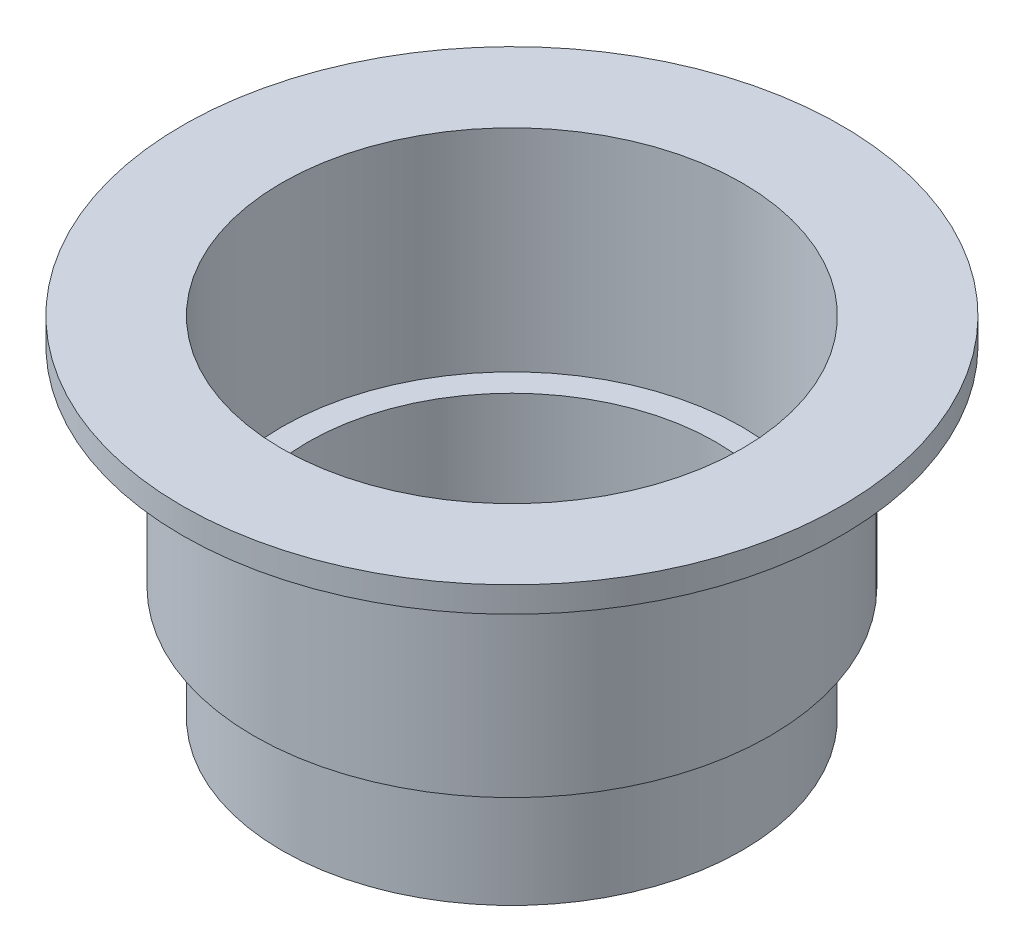
ISO-10303-21;
HEADER;
FILE_DESCRIPTION(('STEP AP214'),'2;1');
FILE_NAME('part.step','',(''),(''),'','','');
FILE_SCHEMA(('AUTOMOTIVE_DESIGN { 1 0 10303 214 1 1 1 1 }'));
ENDSEC;
DATA;
#1=APPLICATION_CONTEXT('core data for automotive mechanical design processes');
#2=APPLICATION_PROTOCOL_DEFINITION('international standard','automotive_design',2000,#1);
#3=PRODUCT_CONTEXT('',#1,'mechanical');
#4=PRODUCT('Part','Part','',(#3));
#5=PRODUCT_RELATED_PRODUCT_CATEGORY('part','',(#4));
#6=PRODUCT_DEFINITION_FORMATION('','',#4);
#7=PRODUCT_DEFINITION_CONTEXT('part definition',#1,'design');
#8=PRODUCT_DEFINITION('design','',#6,#7);
#9=PRODUCT_DEFINITION_SHAPE('','',#8);
#10=(LENGTH_UNIT() NAMED_UNIT(*) SI_UNIT(.MILLI.,.METRE.));
#11=(NAMED_UNIT(*) PLANE_ANGLE_UNIT() SI_UNIT($,.RADIAN.));
#12=(NAMED_UNIT(*) SI_UNIT($,.STERADIAN.) SOLID_ANGLE_UNIT());
#13=UNCERTAINTY_MEASURE_WITH_UNIT(LENGTH_MEASURE(1.E-05),#10,'distance_accuracy_value','');
#14=(GEOMETRIC_REPRESENTATION_CONTEXT(3) GLOBAL_UNCERTAINTY_ASSIGNED_CONTEXT((#13)) GLOBAL_UNIT_ASSIGNED_CONTEXT((#10,
#11,#12)) REPRESENTATION_CONTEXT('',''));
#15=CARTESIAN_POINT('',(0.,0.,0.));
#16=DIRECTION('',(0.,0.,1.));
#17=DIRECTION('',(1.,0.,0.));
#18=AXIS2_PLACEMENT_3D('',#15,#16,#17);
#19=CARTESIAN_POINT('',(0.,6.93554023814184,0.));
#20=DIRECTION('',(0.,1.,0.));
#21=DIRECTION('',(0.,0.,1.));
#22=AXIS2_PLACEMENT_3D('',#19,#20,#21);
#23=CYLINDRICAL_SURFACE('',#22,31.5);
#24=CARTESIAN_POINT('',(0.,-2.44,0.));
#25=DIRECTION('',(0.,1.,0.));
#26=DIRECTION('',(0.,0.,1.));
#27=AXIS2_PLACEMENT_3D('',#24,#25,#26);
#28=CIRCLE('',#27,31.5);
#29=CARTESIAN_POINT('',(0.,-2.44,31.5));
#30=VERTEX_POINT('',#29);
#31=EDGE_CURVE('E67',#30,#30,#28,.T.);
#32=ORIENTED_EDGE('',*,*,#31,.T.);
#33=EDGE_LOOP('',(#32));
#34=FACE_BOUND('',#33,.T.);
#35=CARTESIAN_POINT('',(0.,0.,0.));
#36=DIRECTION('',(0.,1.,0.));
#37=DIRECTION('',(0.,0.,1.));
#38=AXIS2_PLACEMENT_3D('',#35,#36,#37);
#39=CIRCLE('',#38,31.5);
#40=CARTESIAN_POINT('',(0.,0.,31.5));
#41=VERTEX_POINT('',#40);
#42=EDGE_CURVE('E39',#41,#41,#39,.T.);
#43=ORIENTED_EDGE('',*,*,#42,.F.);
#44=EDGE_LOOP('',(#43));
#45=FACE_BOUND('',#44,.T.);
#46=ADVANCED_FACE('F32',(#34,#45),#23,.T.);
#47=CARTESIAN_POINT('',(0.,0.,0.));
#48=DIRECTION('',(0.,1.,0.));
#49=DIRECTION('',(0.,0.,1.));
#50=AXIS2_PLACEMENT_3D('',#47,#48,#49);
#51=PLANE('',#50);
#52=ORIENTED_EDGE('',*,*,#42,.T.);
#53=EDGE_LOOP('',(#52));
#54=FACE_BOUND('',#53,.T.);
#55=CARTESIAN_POINT('',(0.,0.,0.));
#56=DIRECTION('',(0.,1.,0.));
#57=DIRECTION('',(0.,0.,1.));
#58=AXIS2_PLACEMENT_3D('',#55,#56,#57);
#59=CIRCLE('',#58,22.);
#60=CARTESIAN_POINT('',(0.,0.,22.));
#61=VERTEX_POINT('',#60);
#62=EDGE_CURVE('E43',#61,#61,#59,.T.);
#63=ORIENTED_EDGE('',*,*,#62,.F.);
#64=EDGE_LOOP('',(#63));
#65=FACE_BOUND('',#64,.T.);
#66=ADVANCED_FACE('F92',(#54,#65),#51,.T.);
#67=CARTESIAN_POINT('',(0.,6.93554023814184,0.));
#68=DIRECTION('',(0.,1.,0.));
#69=DIRECTION('',(0.,0.,1.));
#70=AXIS2_PLACEMENT_3D('',#67,#68,#69);
#71=CYLINDRICAL_SURFACE('',#70,22.);
#72=CARTESIAN_POINT('',(0.,-20.2,0.));
#73=DIRECTION('',(0.,1.,0.));
#74=DIRECTION('',(0.,0.,1.));
#75=AXIS2_PLACEMENT_3D('',#72,#73,#74);
#76=CIRCLE('',#75,22.);
#77=CARTESIAN_POINT('',(0.,-20.2,22.));
#78=VERTEX_POINT('',#77);
#79=EDGE_CURVE('E47',#78,#78,#76,.T.);
#80=ORIENTED_EDGE('',*,*,#79,.F.);
#81=EDGE_LOOP('',(#80));
#82=FACE_BOUND('',#81,.T.);
#83=ORIENTED_EDGE('',*,*,#62,.T.);
#84=EDGE_LOOP('',(#83));
#85=FACE_BOUND('',#84,.T.);
#86=ADVANCED_FACE('F96',(#82,#85),#71,.F.);
#87=CARTESIAN_POINT('',(0.,-20.2,0.));
#88=DIRECTION('',(0.,-1.,0.));
#89=DIRECTION('',(0.,0.,-1.));
#90=AXIS2_PLACEMENT_3D('',#87,#88,#89);
#91=PLANE('',#90);
#92=CARTESIAN_POINT('',(0.,-20.2,0.));
#93=DIRECTION('',(0.,1.,0.));
#94=DIRECTION('',(0.,0.,1.));
#95=AXIS2_PLACEMENT_3D('',#92,#93,#94);
#96=CIRCLE('',#95,19.5);
#97=CARTESIAN_POINT('',(0.,-20.2,19.5));
#98=VERTEX_POINT('',#97);
#99=EDGE_CURVE('E52',#98,#98,#96,.T.);
#100=ORIENTED_EDGE('',*,*,#99,.F.);
#101=EDGE_LOOP('',(#100));
#102=FACE_BOUND('',#101,.T.);
#103=ORIENTED_EDGE('',*,*,#79,.T.);
#104=EDGE_LOOP('',(#103));
#105=FACE_BOUND('',#104,.T.);
#106=ADVANCED_FACE('F101',(#102,#105),#91,.F.);
#107=CARTESIAN_POINT('',(0.,6.93554023814184,0.));
#108=DIRECTION('',(0.,1.,0.));
#109=DIRECTION('',(0.,0.,1.));
#110=AXIS2_PLACEMENT_3D('',#107,#108,#109);
#111=CYLINDRICAL_SURFACE('',#110,19.5);
#112=ORIENTED_EDGE('',*,*,#99,.T.);
#113=EDGE_LOOP('',(#112));
#114=FACE_BOUND('',#113,.T.);
#115=CARTESIAN_POINT('',(0.,-33.16,0.));
#116=DIRECTION('',(0.,-1.,0.));
#117=DIRECTION('',(0.,0.,-1.));
#118=AXIS2_PLACEMENT_3D('',#115,#116,#117);
#119=CIRCLE('',#118,19.5);
#120=CARTESIAN_POINT('',(0.,-33.16,-19.5));
#121=VERTEX_POINT('',#120);
#122=EDGE_CURVE('E10',#121,#121,#119,.F.);
#123=ORIENTED_EDGE('',*,*,#122,.F.);
#124=EDGE_LOOP('',(#123));
#125=FACE_BOUND('',#124,.T.);
#126=ADVANCED_FACE('F77',(#114,#125),#111,.F.);
#127=CARTESIAN_POINT('',(0.,-2.44,0.));
#128=DIRECTION('',(0.,1.,0.));
#129=DIRECTION('',(0.,0.,1.));
#130=AXIS2_PLACEMENT_3D('',#127,#128,#129);
#131=PLANE('',#130);
#132=ORIENTED_EDGE('',*,*,#31,.F.);
#133=EDGE_LOOP('',(#132));
#134=FACE_BOUND('',#133,.T.);
#135=CARTESIAN_POINT('',(0.,-2.44,0.));
#136=DIRECTION('',(0.,1.,0.));
#137=DIRECTION('',(0.,0.,1.));
#138=AXIS2_PLACEMENT_3D('',#135,#136,#137);
#139=CIRCLE('',#138,24.665);
#140=CARTESIAN_POINT('',(0.,-2.44,24.665));
#141=VERTEX_POINT('',#140);
#142=EDGE_CURVE('E64',#141,#141,#139,.T.);
#143=ORIENTED_EDGE('',*,*,#142,.T.);
#144=EDGE_LOOP('',(#143));
#145=FACE_BOUND('',#144,.T.);
#146=ADVANCED_FACE('F73',(#134,#145),#131,.F.);
#147=CARTESIAN_POINT('',(0.,6.93554023814184,0.));
#148=DIRECTION('',(0.,1.,0.));
#149=DIRECTION('',(0.,0.,1.));
#150=AXIS2_PLACEMENT_3D('',#147,#148,#149);
#151=CYLINDRICAL_SURFACE('',#150,24.665);
#152=CARTESIAN_POINT('',(0.,-22.45,0.));
#153=DIRECTION('',(0.,1.,0.));
#154=DIRECTION('',(0.,0.,1.));
#155=AXIS2_PLACEMENT_3D('',#152,#153,#154);
#156=CIRCLE('',#155,24.665);
#157=CARTESIAN_POINT('',(0.,-22.45,24.665));
#158=VERTEX_POINT('',#157);
#159=EDGE_CURVE('E61',#158,#158,#156,.T.);
#160=ORIENTED_EDGE('',*,*,#159,.T.);
#161=EDGE_LOOP('',(#160));
#162=FACE_BOUND('',#161,.T.);
#163=ORIENTED_EDGE('',*,*,#142,.F.);
#164=EDGE_LOOP('',(#163));
#165=FACE_BOUND('',#164,.T.);
#166=ADVANCED_FACE('F76',(#162,#165),#151,.T.);
#167=CARTESIAN_POINT('',(0.,-22.45,0.));
#168=DIRECTION('',(0.,1.,0.));
#169=DIRECTION('',(0.,0.,1.));
#170=AXIS2_PLACEMENT_3D('',#167,#168,#169);
#171=PLANE('',#170);
#172=ORIENTED_EDGE('',*,*,#159,.F.);
#173=EDGE_LOOP('',(#172));
#174=FACE_BOUND('',#173,.T.);
#175=CARTESIAN_POINT('',(0.,-22.45,0.));
#176=DIRECTION('',(0.,1.,0.));
#177=DIRECTION('',(0.,0.,1.));
#178=AXIS2_PLACEMENT_3D('',#175,#176,#177);
#179=CIRCLE('',#178,22.);
#180=CARTESIAN_POINT('',(0.,-22.45,22.));
#181=VERTEX_POINT('',#180);
#182=EDGE_CURVE('E58',#181,#181,#179,.T.);
#183=ORIENTED_EDGE('',*,*,#182,.T.);
#184=EDGE_LOOP('',(#183));
#185=FACE_BOUND('',#184,.T.);
#186=ADVANCED_FACE('F82',(#174,#185),#171,.F.);
#187=CARTESIAN_POINT('',(0.,6.93554023814184,0.));
#188=DIRECTION('',(0.,1.,0.));
#189=DIRECTION('',(0.,0.,1.));
#190=AXIS2_PLACEMENT_3D('',#187,#188,#189);
#191=CYLINDRICAL_SURFACE('',#190,22.);
#192=CARTESIAN_POINT('',(0.,-33.26,0.));
#193=DIRECTION('',(0.,1.,0.));
#194=DIRECTION('',(0.,0.,1.));
#195=AXIS2_PLACEMENT_3D('',#192,#193,#194);
#196=CIRCLE('',#195,22.);
#197=CARTESIAN_POINT('',(0.,-33.26,22.));
#198=VERTEX_POINT('',#197);
#199=EDGE_CURVE('E55',#198,#198,#196,.T.);
#200=ORIENTED_EDGE('',*,*,#199,.T.);
#201=EDGE_LOOP('',(#200));
#202=FACE_BOUND('',#201,.T.);
#203=ORIENTED_EDGE('',*,*,#182,.F.);
#204=EDGE_LOOP('',(#203));
#205=FACE_BOUND('',#204,.T.);
#206=ADVANCED_FACE('F88',(#202,#205),#191,.T.);
#207=CARTESIAN_POINT('',(0.,-33.26,0.));
#208=DIRECTION('',(0.,-1.,0.));
#209=DIRECTION('',(0.,0.,-1.));
#210=AXIS2_PLACEMENT_3D('',#207,#208,#209);
#211=PLANE('',#210);
#212=ORIENTED_EDGE('',*,*,#199,.F.);
#213=EDGE_LOOP('',(#212));
#214=FACE_BOUND('',#213,.T.);
#215=ADVANCED_FACE('F109',(#214),#211,.T.);
#216=CARTESIAN_POINT('',(19.5,-33.16,0.));
#217=DIRECTION('',(0.,-1.,0.));
#218=DIRECTION('',(0.,0.,-1.));
#219=AXIS2_PLACEMENT_3D('',#216,#217,#218);
#220=PLANE('',#219);
#221=ORIENTED_EDGE('',*,*,#122,.T.);
#222=EDGE_LOOP('',(#221));
#223=FACE_BOUND('',#222,.T.);
#224=ADVANCED_FACE('F34',(#223),#220,.F.);
#225=CLOSED_SHELL('',(#46,#66,#86,#106,#126,#146,#166,#186,#206,#215,#224));
#226=MANIFOLD_SOLID_BREP('B2',#225);
#227=ADVANCED_BREP_SHAPE_REPRESENTATION('',(#18,#226),#14);
#228=SHAPE_DEFINITION_REPRESENTATION(#9,#227);
ENDSEC;
END-ISO-10303-21;
